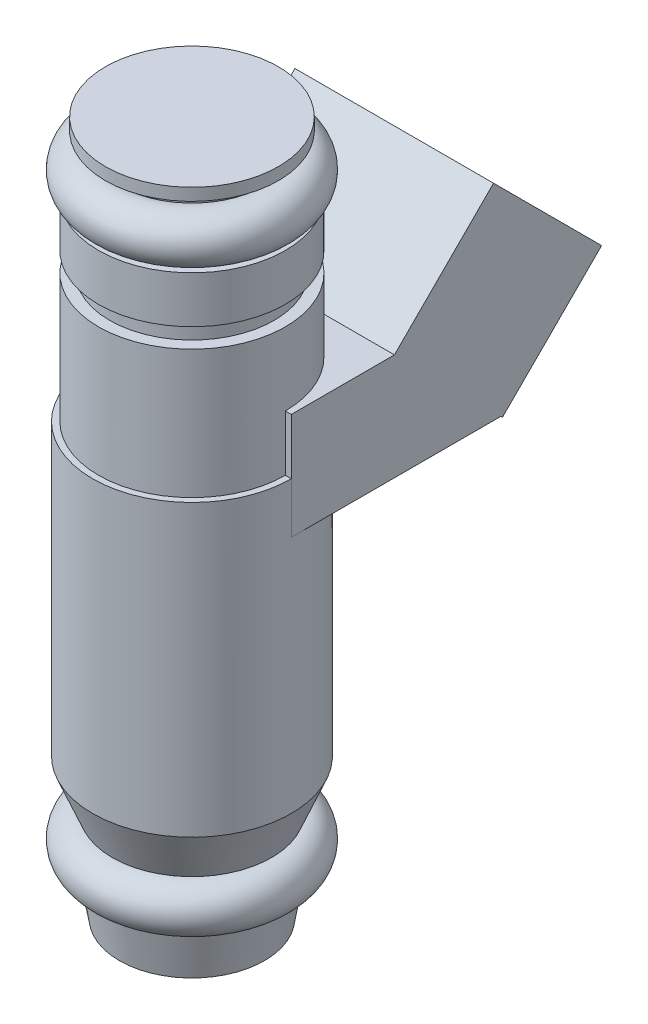
ISO-10303-21;
HEADER;
FILE_DESCRIPTION(('STEP AP214'),'2;1');
FILE_NAME('part.step','',(''),(''),'','','');
FILE_SCHEMA(('AUTOMOTIVE_DESIGN { 1 0 10303 214 1 1 1 1 }'));
ENDSEC;
DATA;
#1=APPLICATION_CONTEXT('core data for automotive mechanical design processes');
#2=APPLICATION_PROTOCOL_DEFINITION('international standard','automotive_design',2000,#1);
#3=PRODUCT_CONTEXT('',#1,'mechanical');
#4=PRODUCT('Part','Part','',(#3));
#5=PRODUCT_RELATED_PRODUCT_CATEGORY('part','',(#4));
#6=PRODUCT_DEFINITION_FORMATION('','',#4);
#7=PRODUCT_DEFINITION_CONTEXT('part definition',#1,'design');
#8=PRODUCT_DEFINITION('design','',#6,#7);
#9=PRODUCT_DEFINITION_SHAPE('','',#8);
#10=(LENGTH_UNIT() NAMED_UNIT(*) SI_UNIT(.MILLI.,.METRE.));
#11=(NAMED_UNIT(*) PLANE_ANGLE_UNIT() SI_UNIT($,.RADIAN.));
#12=(NAMED_UNIT(*) SI_UNIT($,.STERADIAN.) SOLID_ANGLE_UNIT());
#13=UNCERTAINTY_MEASURE_WITH_UNIT(LENGTH_MEASURE(1.E-05),#10,'distance_accuracy_value','');
#14=(GEOMETRIC_REPRESENTATION_CONTEXT(3) GLOBAL_UNCERTAINTY_ASSIGNED_CONTEXT((#13)) GLOBAL_UNIT_ASSIGNED_CONTEXT((#10,
#11,#12)) REPRESENTATION_CONTEXT('',''));
#15=CARTESIAN_POINT('',(0.,0.,0.));
#16=DIRECTION('',(0.,0.,1.));
#17=DIRECTION('',(1.,0.,0.));
#18=AXIS2_PLACEMENT_3D('',#15,#16,#17);
#19=CARTESIAN_POINT('',(0.,42.4843170298998,0.));
#20=DIRECTION('',(0.,1.,0.));
#21=DIRECTION('',(0.,0.,1.));
#22=AXIS2_PLACEMENT_3D('',#19,#20,#21);
#23=CYLINDRICAL_SURFACE('',#22,6.3463459854996);
#24=CARTESIAN_POINT('',(0.,34.6075,0.));
#25=DIRECTION('',(0.,1.,0.));
#26=DIRECTION('',(0.,0.,1.));
#27=AXIS2_PLACEMENT_3D('',#24,#25,#26);
#28=CIRCLE('',#27,6.3463459854996);
#29=CARTESIAN_POINT('',(0.,34.6075,6.3463459854996));
#30=VERTEX_POINT('',#29);
#31=EDGE_CURVE('E234',#30,#30,#28,.T.);
#32=ORIENTED_EDGE('',*,*,#31,.T.);
#33=EDGE_LOOP('',(#32));
#34=FACE_BOUND('',#33,.T.);
#35=CARTESIAN_POINT('',(0.,37.7825,0.));
#36=DIRECTION('',(0.,1.,0.));
#37=DIRECTION('',(0.,0.,1.));
#38=AXIS2_PLACEMENT_3D('',#35,#36,#37);
#39=CIRCLE('',#38,6.3463459854996);
#40=CARTESIAN_POINT('',(0.,37.7825,6.3463459854996));
#41=VERTEX_POINT('',#40);
#42=EDGE_CURVE('E189',#41,#41,#39,.T.);
#43=ORIENTED_EDGE('',*,*,#42,.F.);
#44=EDGE_LOOP('',(#43));
#45=FACE_BOUND('',#44,.T.);
#46=ADVANCED_FACE('F32',(#34,#45),#23,.T.);
#47=CARTESIAN_POINT('',(0.,34.6075,6.3463459854996));
#48=DIRECTION('',(0.,-1.,0.));
#49=DIRECTION('',(0.,0.,-1.));
#50=AXIS2_PLACEMENT_3D('',#47,#48,#49);
#51=PLANE('',#50);
#52=CARTESIAN_POINT('',(0.,34.6075,0.));
#53=DIRECTION('',(0.,1.,0.));
#54=DIRECTION('',(0.,0.,1.));
#55=AXIS2_PLACEMENT_3D('',#52,#53,#54);
#56=CIRCLE('',#55,5.588);
#57=CARTESIAN_POINT('',(0.,34.6075,5.588));
#58=VERTEX_POINT('',#57);
#59=EDGE_CURVE('E231',#58,#58,#56,.T.);
#60=ORIENTED_EDGE('',*,*,#59,.T.);
#61=EDGE_LOOP('',(#60));
#62=FACE_BOUND('',#61,.T.);
#63=ORIENTED_EDGE('',*,*,#31,.F.);
#64=EDGE_LOOP('',(#63));
#65=FACE_BOUND('',#64,.T.);
#66=ADVANCED_FACE('F275',(#62,#65),#51,.T.);
#67=CARTESIAN_POINT('',(0.,42.4843170298998,0.));
#68=DIRECTION('',(0.,1.,0.));
#69=DIRECTION('',(0.,0.,1.));
#70=AXIS2_PLACEMENT_3D('',#67,#68,#69);
#71=CYLINDRICAL_SURFACE('',#70,5.588);
#72=CARTESIAN_POINT('',(0.,33.2867,0.));
#73=DIRECTION('',(0.,1.,0.));
#74=DIRECTION('',(0.,0.,1.));
#75=AXIS2_PLACEMENT_3D('',#72,#73,#74);
#76=CIRCLE('',#75,5.588);
#77=CARTESIAN_POINT('',(0.,33.2867,5.588));
#78=VERTEX_POINT('',#77);
#79=EDGE_CURVE('E228',#78,#78,#76,.T.);
#80=ORIENTED_EDGE('',*,*,#79,.T.);
#81=EDGE_LOOP('',(#80));
#82=FACE_BOUND('',#81,.T.);
#83=ORIENTED_EDGE('',*,*,#59,.F.);
#84=EDGE_LOOP('',(#83));
#85=FACE_BOUND('',#84,.T.);
#86=ADVANCED_FACE('F280',(#82,#85),#71,.T.);
#87=CARTESIAN_POINT('',(0.,33.2867,5.588));
#88=DIRECTION('',(0.,1.,0.));
#89=DIRECTION('',(0.,0.,1.));
#90=AXIS2_PLACEMENT_3D('',#87,#88,#89);
#91=PLANE('',#90);
#92=CARTESIAN_POINT('',(0.,33.2867,0.));
#93=DIRECTION('',(0.,1.,0.));
#94=DIRECTION('',(0.,0.,1.));
#95=AXIS2_PLACEMENT_3D('',#92,#93,#94);
#96=CIRCLE('',#95,6.34634598549959);
#97=CARTESIAN_POINT('',(0.,33.2867,6.34634598549959));
#98=VERTEX_POINT('',#97);
#99=EDGE_CURVE('E225',#98,#98,#96,.T.);
#100=ORIENTED_EDGE('',*,*,#99,.T.);
#101=EDGE_LOOP('',(#100));
#102=FACE_BOUND('',#101,.T.);
#103=ORIENTED_EDGE('',*,*,#79,.F.);
#104=EDGE_LOOP('',(#103));
#105=FACE_BOUND('',#104,.T.);
#106=ADVANCED_FACE('F343',(#102,#105),#91,.T.);
#107=CARTESIAN_POINT('',(0.,42.4843170298998,0.));
#108=DIRECTION('',(0.,1.,0.));
#109=DIRECTION('',(0.,0.,1.));
#110=AXIS2_PLACEMENT_3D('',#107,#108,#109);
#111=CYLINDRICAL_SURFACE('',#110,6.34634598549959);
#112=DIRECTION('',(0.,1.,0.));
#113=VECTOR('',#112,1.);
#114=CARTESIAN_POINT('',(6.34634598549959,42.4843170298998,0.));
#115=LINE('',#114,#113);
#116=CARTESIAN_POINT('',(6.34634598549959,28.3369046984566,0.));
#117=VERTEX_POINT('',#116);
#118=CARTESIAN_POINT('',(6.34634598549959,24.5525120865286,0.));
#119=VERTEX_POINT('',#118);
#120=EDGE_CURVE('E176',#117,#119,#115,.F.);
#121=ORIENTED_EDGE('',*,*,#120,.F.);
#122=CARTESIAN_POINT('',(0.,28.3369046984566,0.));
#123=DIRECTION('',(0.,1.,0.));
#124=DIRECTION('',(0.,0.,1.));
#125=AXIS2_PLACEMENT_3D('',#122,#123,#124);
#126=CIRCLE('',#125,6.34634598549959);
#127=CARTESIAN_POINT('',(-6.34634598549959,28.3369046984566,0.));
#128=VERTEX_POINT('',#127);
#129=EDGE_CURVE('E11',#128,#117,#126,.F.);
#130=ORIENTED_EDGE('',*,*,#129,.F.);
#131=DIRECTION('',(0.,1.,0.));
#132=VECTOR('',#131,1.);
#133=CARTESIAN_POINT('',(-6.34634598549959,42.4843170298998,0.));
#134=LINE('',#133,#132);
#135=CARTESIAN_POINT('',(-6.34634598549959,24.5525120865286,0.));
#136=VERTEX_POINT('',#135);
#137=EDGE_CURVE('E187',#136,#128,#134,.T.);
#138=ORIENTED_EDGE('',*,*,#137,.F.);
#139=CARTESIAN_POINT('',(0.,24.5525120865286,0.));
#140=DIRECTION('',(0.,1.,0.));
#141=DIRECTION('',(0.,0.,1.));
#142=AXIS2_PLACEMENT_3D('',#139,#140,#141);
#143=CIRCLE('',#142,6.34634598549959);
#144=EDGE_CURVE('E222',#136,#119,#143,.T.);
#145=ORIENTED_EDGE('',*,*,#144,.T.);
#146=EDGE_LOOP('',(#121,#130,#138,#145));
#147=FACE_BOUND('',#146,.T.);
#148=ORIENTED_EDGE('',*,*,#99,.F.);
#149=EDGE_LOOP('',(#148));
#150=FACE_BOUND('',#149,.T.);
#151=ADVANCED_FACE('F257',(#147,#150),#111,.T.);
#152=CARTESIAN_POINT('',(0.,24.5525120865286,6.34634598549959));
#153=DIRECTION('',(0.,1.,0.));
#154=DIRECTION('',(0.,0.,1.));
#155=AXIS2_PLACEMENT_3D('',#152,#153,#154);
#156=PLANE('',#155);
#157=DIRECTION('',(1.,0.,0.));
#158=VECTOR('',#157,1.);
#159=CARTESIAN_POINT('',(0.,24.5525120865286,0.));
#160=LINE('',#159,#158);
#161=CARTESIAN_POINT('',(-6.75000000000001,24.5525120865286,0.));
#162=VERTEX_POINT('',#161);
#163=EDGE_CURVE('E56',#162,#136,#160,.T.);
#164=ORIENTED_EDGE('',*,*,#163,.F.);
#165=CARTESIAN_POINT('',(0.,24.5525120865286,0.));
#166=DIRECTION('',(0.,1.,0.));
#167=DIRECTION('',(0.,0.,1.));
#168=AXIS2_PLACEMENT_3D('',#165,#166,#167);
#169=CIRCLE('',#168,6.75000000000001);
#170=CARTESIAN_POINT('',(6.75000000000001,24.5525120865286,0.));
#171=VERTEX_POINT('',#170);
#172=EDGE_CURVE('E219',#162,#171,#169,.T.);
#173=ORIENTED_EDGE('',*,*,#172,.T.);
#174=EDGE_CURVE('E174',#119,#171,#160,.T.);
#175=ORIENTED_EDGE('',*,*,#174,.F.);
#176=ORIENTED_EDGE('',*,*,#144,.F.);
#177=EDGE_LOOP('',(#164,#173,#175,#176));
#178=FACE_BOUND('',#177,.T.);
#179=ADVANCED_FACE('F253',(#178),#156,.T.);
#180=CARTESIAN_POINT('',(0.,42.4843170298998,0.));
#181=DIRECTION('',(0.,1.,0.));
#182=DIRECTION('',(0.,0.,1.));
#183=AXIS2_PLACEMENT_3D('',#180,#181,#182);
#184=CYLINDRICAL_SURFACE('',#183,6.75000000000001);
#185=DIRECTION('',(0.,1.,0.));
#186=VECTOR('',#185,1.);
#187=CARTESIAN_POINT('',(6.75000000000001,28.3369046984566,0.));
#188=LINE('',#187,#186);
#189=CARTESIAN_POINT('',(6.75000000000001,21.1028738939092,0.));
#190=VERTEX_POINT('',#189);
#191=EDGE_CURVE('E159',#190,#171,#188,.T.);
#192=ORIENTED_EDGE('',*,*,#191,.T.);
#193=ORIENTED_EDGE('',*,*,#172,.F.);
#194=DIRECTION('',(0.,1.,0.));
#195=VECTOR('',#194,1.);
#196=CARTESIAN_POINT('',(-6.75000000000001,42.4843170298998,0.));
#197=LINE('',#196,#195);
#198=CARTESIAN_POINT('',(-6.75000000000001,21.1028738939092,0.));
#199=VERTEX_POINT('',#198);
#200=EDGE_CURVE('E237',#162,#199,#197,.F.);
#201=ORIENTED_EDGE('',*,*,#200,.T.);
#202=CARTESIAN_POINT('',(0.,21.1028738939092,0.));
#203=DIRECTION('',(0.,-1.,0.));
#204=DIRECTION('',(0.,0.,-1.));
#205=AXIS2_PLACEMENT_3D('',#202,#203,#204);
#206=CIRCLE('',#205,6.75000000000001);
#207=EDGE_CURVE('E40',#190,#199,#206,.F.);
#208=ORIENTED_EDGE('',*,*,#207,.F.);
#209=EDGE_LOOP('',(#192,#193,#201,#208));
#210=FACE_BOUND('',#209,.T.);
#211=CARTESIAN_POINT('',(0.,4.85143780799259,0.));
#212=DIRECTION('',(0.,1.,0.));
#213=DIRECTION('',(0.,0.,1.));
#214=AXIS2_PLACEMENT_3D('',#211,#212,#213);
#215=CIRCLE('',#214,6.75000000000001);
#216=CARTESIAN_POINT('',(0.,4.85143780799259,6.75000000000001));
#217=VERTEX_POINT('',#216);
#218=EDGE_CURVE('E216',#217,#217,#215,.T.);
#219=ORIENTED_EDGE('',*,*,#218,.T.);
#220=EDGE_LOOP('',(#219));
#221=FACE_BOUND('',#220,.T.);
#222=ADVANCED_FACE('F247',(#210,#221),#184,.T.);
#223=CARTESIAN_POINT('',(0.,4.85143780799259,0.));
#224=DIRECTION('',(0.,1.,0.));
#225=DIRECTION('',(0.,0.,1.));
#226=AXIS2_PLACEMENT_3D('',#223,#224,#225);
#227=CONICAL_SURFACE('',#226,6.75000000000001,0.388909811684261);
#228=CARTESIAN_POINT('',(0.,1.5875,0.));
#229=DIRECTION('',(0.,1.,0.));
#230=DIRECTION('',(0.,0.,1.));
#231=AXIS2_PLACEMENT_3D('',#228,#229,#230);
#232=CIRCLE('',#231,5.41250000000001);
#233=CARTESIAN_POINT('',(0.,1.5875,5.41250000000001));
#234=VERTEX_POINT('',#233);
#235=EDGE_CURVE('E213',#234,#234,#232,.T.);
#236=ORIENTED_EDGE('',*,*,#235,.T.);
#237=EDGE_LOOP('',(#236));
#238=FACE_BOUND('',#237,.T.);
#239=ORIENTED_EDGE('',*,*,#218,.F.);
#240=EDGE_LOOP('',(#239));
#241=FACE_BOUND('',#240,.T.);
#242=ADVANCED_FACE('F332',(#238,#241),#227,.T.);
#243=CARTESIAN_POINT('',(0.,0.,0.));
#244=DIRECTION('',(0.,1.,0.));
#245=DIRECTION('',(0.,0.,1.));
#246=AXIS2_PLACEMENT_3D('',#243,#244,#245);
#247=TOROIDAL_SURFACE('',#246,5.41250000000001,1.5875);
#248=CARTESIAN_POINT('',(0.,-1.58508674841474,0.));
#249=DIRECTION('',(0.,1.,0.));
#250=DIRECTION('',(0.,0.,1.));
#251=AXIS2_PLACEMENT_3D('',#248,#249,#250);
#252=CIRCLE('',#251,5.49999999999999);
#253=CARTESIAN_POINT('',(0.,-1.58508674841474,5.49999999999999));
#254=VERTEX_POINT('',#253);
#255=EDGE_CURVE('E210',#254,#254,#252,.T.);
#256=ORIENTED_EDGE('',*,*,#255,.T.);
#257=EDGE_LOOP('',(#256));
#258=FACE_BOUND('',#257,.T.);
#259=ORIENTED_EDGE('',*,*,#235,.F.);
#260=EDGE_LOOP('',(#259));
#261=FACE_BOUND('',#260,.T.);
#262=ADVANCED_FACE('F328',(#258,#261),#247,.T.);
#263=CARTESIAN_POINT('',(0.,-1.58508674841474,0.));
#264=DIRECTION('',(0.,1.,0.));
#265=DIRECTION('',(0.,0.,1.));
#266=AXIS2_PLACEMENT_3D('',#263,#264,#265);
#267=CONICAL_SURFACE('',#266,5.49999999999999,0.178973591686608);
#268=CARTESIAN_POINT('',(0.,-4.7156829701002,0.));
#269=DIRECTION('',(0.,1.,0.));
#270=DIRECTION('',(0.,0.,1.));
#271=AXIS2_PLACEMENT_3D('',#268,#269,#270);
#272=CIRCLE('',#271,4.93364593188048);
#273=CARTESIAN_POINT('',(0.,-4.7156829701002,4.93364593188048));
#274=VERTEX_POINT('',#273);
#275=EDGE_CURVE('E207',#274,#274,#272,.T.);
#276=ORIENTED_EDGE('',*,*,#275,.T.);
#277=EDGE_LOOP('',(#276));
#278=FACE_BOUND('',#277,.T.);
#279=ORIENTED_EDGE('',*,*,#255,.F.);
#280=EDGE_LOOP('',(#279));
#281=FACE_BOUND('',#280,.T.);
#282=ADVANCED_FACE('F322',(#278,#281),#267,.T.);
#283=CARTESIAN_POINT('',(0.,-4.7156829701002,4.93364593188048));
#284=DIRECTION('',(0.,-1.,0.));
#285=DIRECTION('',(0.,0.,-1.));
#286=AXIS2_PLACEMENT_3D('',#283,#284,#285);
#287=PLANE('',#286);
#288=ORIENTED_EDGE('',*,*,#275,.F.);
#289=EDGE_LOOP('',(#288));
#290=FACE_BOUND('',#289,.T.);
#291=ADVANCED_FACE('F317',(#290),#287,.T.);
#292=CARTESIAN_POINT('',(0.,42.4843170298998,0.));
#293=DIRECTION('',(0.,1.,0.));
#294=DIRECTION('',(0.,0.,1.));
#295=AXIS2_PLACEMENT_3D('',#292,#293,#294);
#296=PLANE('',#295);
#297=CARTESIAN_POINT('',(0.,42.4843170298998,0.));
#298=DIRECTION('',(0.,1.,0.));
#299=DIRECTION('',(0.,0.,1.));
#300=AXIS2_PLACEMENT_3D('',#297,#298,#299);
#301=CIRCLE('',#300,5.88002652383953);
#302=CARTESIAN_POINT('',(0.,42.4843170298998,5.88002652383953));
#303=VERTEX_POINT('',#302);
#304=EDGE_CURVE('E204',#303,#303,#301,.T.);
#305=ORIENTED_EDGE('',*,*,#304,.T.);
#306=EDGE_LOOP('',(#305));
#307=FACE_BOUND('',#306,.T.);
#308=ADVANCED_FACE('F312',(#307),#296,.T.);
#309=CARTESIAN_POINT('',(0.,42.4843170298998,0.));
#310=DIRECTION('',(0.,1.,0.));
#311=DIRECTION('',(0.,0.,1.));
#312=AXIS2_PLACEMENT_3D('',#309,#310,#311);
#313=CYLINDRICAL_SURFACE('',#312,5.88002652383953);
#314=CARTESIAN_POINT('',(0.,41.6542235018854,0.));
#315=DIRECTION('',(0.,1.,0.));
#316=DIRECTION('',(0.,0.,1.));
#317=AXIS2_PLACEMENT_3D('',#314,#315,#316);
#318=CIRCLE('',#317,5.88002652383953);
#319=CARTESIAN_POINT('',(0.,41.6542235018854,5.88002652383953));
#320=VERTEX_POINT('',#319);
#321=EDGE_CURVE('E201',#320,#320,#318,.T.);
#322=ORIENTED_EDGE('',*,*,#321,.T.);
#323=EDGE_LOOP('',(#322));
#324=FACE_BOUND('',#323,.T.);
#325=ORIENTED_EDGE('',*,*,#304,.F.);
#326=EDGE_LOOP('',(#325));
#327=FACE_BOUND('',#326,.T.);
#328=ADVANCED_FACE('F306',(#324,#327),#313,.T.);
#329=CARTESIAN_POINT('',(0.,41.6542235018854,5.88002652383953));
#330=DIRECTION('',(0.,-1.,0.));
#331=DIRECTION('',(0.,0.,-1.));
#332=AXIS2_PLACEMENT_3D('',#329,#330,#331);
#333=PLANE('',#332);
#334=CARTESIAN_POINT('',(0.,41.6542235018854,0.));
#335=DIRECTION('',(0.,1.,0.));
#336=DIRECTION('',(0.,0.,1.));
#337=AXIS2_PLACEMENT_3D('',#334,#335,#336);
#338=CIRCLE('',#337,4.93364593188048);
#339=CARTESIAN_POINT('',(0.,41.6542235018854,4.93364593188048));
#340=VERTEX_POINT('',#339);
#341=EDGE_CURVE('E198',#340,#340,#338,.T.);
#342=ORIENTED_EDGE('',*,*,#341,.T.);
#343=EDGE_LOOP('',(#342));
#344=FACE_BOUND('',#343,.T.);
#345=ORIENTED_EDGE('',*,*,#321,.F.);
#346=EDGE_LOOP('',(#345));
#347=FACE_BOUND('',#346,.T.);
#348=ADVANCED_FACE('F300',(#344,#347),#333,.T.);
#349=CARTESIAN_POINT('',(0.,42.4843170298998,0.));
#350=DIRECTION('',(0.,1.,0.));
#351=DIRECTION('',(0.,0.,1.));
#352=AXIS2_PLACEMENT_3D('',#349,#350,#351);
#353=CYLINDRICAL_SURFACE('',#352,4.93364593188048);
#354=CARTESIAN_POINT('',(0.,40.883557079018,0.));
#355=DIRECTION('',(0.,1.,0.));
#356=DIRECTION('',(0.,0.,1.));
#357=AXIS2_PLACEMENT_3D('',#354,#355,#356);
#358=CIRCLE('',#357,4.93364593188048);
#359=CARTESIAN_POINT('',(0.,40.883557079018,4.93364593188048));
#360=VERTEX_POINT('',#359);
#361=EDGE_CURVE('E195',#360,#360,#358,.T.);
#362=ORIENTED_EDGE('',*,*,#361,.T.);
#363=EDGE_LOOP('',(#362));
#364=FACE_BOUND('',#363,.T.);
#365=ORIENTED_EDGE('',*,*,#341,.F.);
#366=EDGE_LOOP('',(#365));
#367=FACE_BOUND('',#366,.T.);
#368=ADVANCED_FACE('F294',(#364,#367),#353,.T.);
#369=CARTESIAN_POINT('',(0.,39.37,0.));
#370=DIRECTION('',(0.,1.,0.));
#371=DIRECTION('',(0.,0.,1.));
#372=AXIS2_PLACEMENT_3D('',#369,#370,#371);
#373=TOROIDAL_SURFACE('',#372,5.4125,1.5875);
#374=CARTESIAN_POINT('',(0.,37.7825,0.));
#375=DIRECTION('',(0.,1.,0.));
#376=DIRECTION('',(0.,0.,1.));
#377=AXIS2_PLACEMENT_3D('',#374,#375,#376);
#378=CIRCLE('',#377,5.4125);
#379=CARTESIAN_POINT('',(0.,37.7825,5.4125));
#380=VERTEX_POINT('',#379);
#381=EDGE_CURVE('E192',#380,#380,#378,.T.);
#382=ORIENTED_EDGE('',*,*,#381,.T.);
#383=EDGE_LOOP('',(#382));
#384=FACE_BOUND('',#383,.T.);
#385=ORIENTED_EDGE('',*,*,#361,.F.);
#386=EDGE_LOOP('',(#385));
#387=FACE_BOUND('',#386,.T.);
#388=ADVANCED_FACE('F288',(#384,#387),#373,.T.);
#389=CARTESIAN_POINT('',(0.,37.7825,5.4125));
#390=DIRECTION('',(0.,1.,0.));
#391=DIRECTION('',(0.,0.,1.));
#392=AXIS2_PLACEMENT_3D('',#389,#390,#391);
#393=PLANE('',#392);
#394=ORIENTED_EDGE('',*,*,#42,.T.);
#395=EDGE_LOOP('',(#394));
#396=FACE_BOUND('',#395,.T.);
#397=ORIENTED_EDGE('',*,*,#381,.F.);
#398=EDGE_LOOP('',(#397));
#399=FACE_BOUND('',#398,.T.);
#400=ADVANCED_FACE('F271',(#396,#399),#393,.T.);
#401=CARTESIAN_POINT('',(-6.75000000000001,21.1028738939092,0.));
#402=DIRECTION('',(0.,0.,1.));
#403=DIRECTION('',(1.,0.,0.));
#404=AXIS2_PLACEMENT_3D('',#401,#402,#403);
#405=PLANE('',#404);
#406=ORIENTED_EDGE('',*,*,#163,.T.);
#407=ORIENTED_EDGE('',*,*,#137,.T.);
#408=DIRECTION('',(-1.,0.,0.));
#409=VECTOR('',#408,1.);
#410=CARTESIAN_POINT('',(-6.75000000000001,28.3369046984566,0.));
#411=LINE('',#410,#409);
#412=CARTESIAN_POINT('',(-6.75000000000001,28.3369046984566,0.));
#413=VERTEX_POINT('',#412);
#414=EDGE_CURVE('E158',#128,#413,#411,.T.);
#415=ORIENTED_EDGE('',*,*,#414,.T.);
#416=DIRECTION('',(0.,-1.,0.));
#417=VECTOR('',#416,1.);
#418=CARTESIAN_POINT('',(-6.75000000000001,28.3369046984566,0.));
#419=LINE('',#418,#417);
#420=EDGE_CURVE('E163',#413,#162,#419,.T.);
#421=ORIENTED_EDGE('',*,*,#420,.T.);
#422=EDGE_LOOP('',(#406,#407,#415,#421));
#423=FACE_BOUND('',#422,.T.);
#424=ADVANCED_FACE('F250',(#423),#405,.T.);
#425=CARTESIAN_POINT('',(6.75000000000001,28.3369046984566,0.));
#426=VERTEX_POINT('',#425);
#427=EDGE_CURVE('E154',#426,#117,#411,.T.);
#428=ORIENTED_EDGE('',*,*,#427,.T.);
#429=ORIENTED_EDGE('',*,*,#120,.T.);
#430=ORIENTED_EDGE('',*,*,#174,.T.);
#431=EDGE_CURVE('E162',#171,#426,#188,.T.);
#432=ORIENTED_EDGE('',*,*,#431,.T.);
#433=EDGE_LOOP('',(#428,#429,#430,#432));
#434=FACE_BOUND('',#433,.T.);
#435=ADVANCED_FACE('F263',(#434),#405,.T.);
#436=CARTESIAN_POINT('',(-6.75000000000001,21.1028738939092,-29.1142230472317));
#437=DIRECTION('',(0.,-1.,0.));
#438=DIRECTION('',(0.,0.,-1.));
#439=AXIS2_PLACEMENT_3D('',#436,#437,#438);
#440=PLANE('',#439);
#441=DIRECTION('',(0.,0.,1.));
#442=VECTOR('',#441,1.);
#443=CARTESIAN_POINT('',(6.75000000000001,21.1028738939092,-29.1142230472317));
#444=LINE('',#443,#442);
#445=CARTESIAN_POINT('',(6.75000000000001,21.1028738939092,-14.2431379600424));
#446=VERTEX_POINT('',#445);
#447=EDGE_CURVE('E171',#446,#190,#444,.T.);
#448=ORIENTED_EDGE('',*,*,#447,.T.);
#449=ORIENTED_EDGE('',*,*,#207,.T.);
#450=DIRECTION('',(0.,0.,1.));
#451=VECTOR('',#450,1.);
#452=CARTESIAN_POINT('',(-6.75000000000001,21.1028738939092,-29.1142230472317));
#453=LINE('',#452,#451);
#454=CARTESIAN_POINT('',(-6.75000000000001,21.1028738939092,-14.2431379600424));
#455=VERTEX_POINT('',#454);
#456=EDGE_CURVE('E48',#455,#199,#453,.T.);
#457=ORIENTED_EDGE('',*,*,#456,.F.);
#458=DIRECTION('',(1.,0.,0.));
#459=VECTOR('',#458,1.);
#460=CARTESIAN_POINT('',(-6.75,21.1028738939092,-14.2431379600424));
#461=LINE('',#460,#459);
#462=EDGE_CURVE('E157',#455,#446,#461,.T.);
#463=ORIENTED_EDGE('',*,*,#462,.T.);
#464=EDGE_LOOP('',(#448,#449,#457,#463));
#465=FACE_BOUND('',#464,.T.);
#466=ADVANCED_FACE('F242',(#465),#440,.T.);
#467=CARTESIAN_POINT('',(6.75000000000001,28.3369046984566,-29.1142230472317));
#468=DIRECTION('',(1.,0.,0.));
#469=DIRECTION('',(0.,0.,-1.));
#470=AXIS2_PLACEMENT_3D('',#467,#468,#469);
#471=PLANE('',#470);
#472=ORIENTED_EDGE('',*,*,#447,.F.);
#473=DIRECTION('',(0.,0.707106781186539,0.707106781186556));
#474=VECTOR('',#473,1.);
#475=CARTESIAN_POINT('',(6.75000000000001,28.3369046984566,-7.00910715549474));
#476=LINE('',#475,#474);
#477=CARTESIAN_POINT('',(6.75000000000001,20.9950755711172,-14.3509362828344));
#478=VERTEX_POINT('',#477);
#479=EDGE_CURVE('E150',#478,#446,#476,.T.);
#480=ORIENTED_EDGE('',*,*,#479,.F.);
#481=DIRECTION('',(0.,-0.707106781186556,0.707106781186539));
#482=VECTOR('',#481,1.);
#483=CARTESIAN_POINT('',(6.75000000000001,27.7302676619191,-21.0861283736362));
#484=LINE('',#483,#482);
#485=CARTESIAN_POINT('',(6.75000000000001,27.7302676619191,-21.0861283736362));
#486=VERTEX_POINT('',#485);
#487=EDGE_CURVE('E137',#486,#478,#484,.T.);
#488=ORIENTED_EDGE('',*,*,#487,.F.);
#489=DIRECTION('',(0.,0.707106781186539,0.707106781186556));
#490=VECTOR('',#489,1.);
#491=CARTESIAN_POINT('',(6.75000000000001,35.0720967892586,-13.7442992462965));
#492=LINE('',#491,#490);
#493=CARTESIAN_POINT('',(6.75000000000001,35.0720967892586,-13.7442992462965));
#494=VERTEX_POINT('',#493);
#495=EDGE_CURVE('E129',#486,#494,#492,.T.);
#496=ORIENTED_EDGE('',*,*,#495,.T.);
#497=DIRECTION('',(0.,-0.707106781186556,0.707106781186539));
#498=VECTOR('',#497,1.);
#499=CARTESIAN_POINT('',(6.75000000000001,35.0720967892586,-13.7442992462965));
#500=LINE('',#499,#498);
#501=CARTESIAN_POINT('',(6.75000000000001,28.3369046984566,-7.00910715549474));
#502=VERTEX_POINT('',#501);
#503=EDGE_CURVE('E111',#494,#502,#500,.T.);
#504=ORIENTED_EDGE('',*,*,#503,.T.);
#505=DIRECTION('',(0.,0.,1.));
#506=VECTOR('',#505,1.);
#507=CARTESIAN_POINT('',(6.75000000000001,28.3369046984566,-29.1142230472317));
#508=LINE('',#507,#506);
#509=EDGE_CURVE('E183',#502,#426,#508,.T.);
#510=ORIENTED_EDGE('',*,*,#509,.T.);
#511=ORIENTED_EDGE('',*,*,#431,.F.);
#512=ORIENTED_EDGE('',*,*,#191,.F.);
#513=EDGE_LOOP('',(#472,#480,#488,#496,#504,#510,#511,#512));
#514=FACE_BOUND('',#513,.T.);
#515=ADVANCED_FACE('F135',(#514),#471,.T.);
#516=CARTESIAN_POINT('',(-6.75000000000001,28.3369046984566,-29.1142230472317));
#517=DIRECTION('',(0.,1.,0.));
#518=DIRECTION('',(0.,0.,1.));
#519=AXIS2_PLACEMENT_3D('',#516,#517,#518);
#520=PLANE('',#519);
#521=ORIENTED_EDGE('',*,*,#414,.F.);
#522=ORIENTED_EDGE('',*,*,#129,.T.);
#523=ORIENTED_EDGE('',*,*,#427,.F.);
#524=ORIENTED_EDGE('',*,*,#509,.F.);
#525=DIRECTION('',(-1.,0.,0.));
#526=VECTOR('',#525,1.);
#527=CARTESIAN_POINT('',(-6.75,28.3369046984566,-7.00910715549474));
#528=LINE('',#527,#526);
#529=CARTESIAN_POINT('',(-6.75000000000001,28.3369046984566,-7.00910715549474));
#530=VERTEX_POINT('',#529);
#531=EDGE_CURVE('E116',#502,#530,#528,.T.);
#532=ORIENTED_EDGE('',*,*,#531,.T.);
#533=DIRECTION('',(0.,0.,1.));
#534=VECTOR('',#533,1.);
#535=CARTESIAN_POINT('',(-6.75000000000001,28.3369046984566,-29.1142230472317));
#536=LINE('',#535,#534);
#537=EDGE_CURVE('E175',#530,#413,#536,.T.);
#538=ORIENTED_EDGE('',*,*,#537,.T.);
#539=EDGE_LOOP('',(#521,#522,#523,#524,#532,#538));
#540=FACE_BOUND('',#539,.T.);
#541=ADVANCED_FACE('F260',(#540),#520,.T.);
#542=CARTESIAN_POINT('',(-6.75000000000001,28.3369046984566,-29.1142230472317));
#543=DIRECTION('',(-1.,0.,0.));
#544=DIRECTION('',(0.,-1.,0.));
#545=AXIS2_PLACEMENT_3D('',#542,#543,#544);
#546=PLANE('',#545);
#547=ORIENTED_EDGE('',*,*,#537,.F.);
#548=DIRECTION('',(0.,-0.707106781186556,0.707106781186539));
#549=VECTOR('',#548,1.);
#550=CARTESIAN_POINT('',(-6.75000000000001,35.0720967892586,-13.7442992462965));
#551=LINE('',#550,#549);
#552=CARTESIAN_POINT('',(-6.75000000000001,35.0720967892586,-13.7442992462965));
#553=VERTEX_POINT('',#552);
#554=EDGE_CURVE('E121',#553,#530,#551,.T.);
#555=ORIENTED_EDGE('',*,*,#554,.F.);
#556=DIRECTION('',(0.,-0.707106781186539,-0.707106781186556));
#557=VECTOR('',#556,1.);
#558=CARTESIAN_POINT('',(-6.75000000000001,35.0720967892586,-13.7442992462965));
#559=LINE('',#558,#557);
#560=CARTESIAN_POINT('',(-6.75000000000001,27.7302676619191,-21.0861283736362));
#561=VERTEX_POINT('',#560);
#562=EDGE_CURVE('E132',#553,#561,#559,.T.);
#563=ORIENTED_EDGE('',*,*,#562,.T.);
#564=DIRECTION('',(0.,-0.707106781186556,0.707106781186539));
#565=VECTOR('',#564,1.);
#566=CARTESIAN_POINT('',(-6.75000000000001,27.7302676619191,-21.0861283736362));
#567=LINE('',#566,#565);
#568=CARTESIAN_POINT('',(-6.75000000000001,20.9950755711172,-14.3509362828344));
#569=VERTEX_POINT('',#568);
#570=EDGE_CURVE('E509',#561,#569,#567,.T.);
#571=ORIENTED_EDGE('',*,*,#570,.T.);
#572=DIRECTION('',(0.,-0.707106781186539,-0.707106781186556));
#573=VECTOR('',#572,1.);
#574=CARTESIAN_POINT('',(-6.75000000000001,28.3369046984566,-7.00910715549474));
#575=LINE('',#574,#573);
#576=EDGE_CURVE('E141',#455,#569,#575,.T.);
#577=ORIENTED_EDGE('',*,*,#576,.F.);
#578=ORIENTED_EDGE('',*,*,#456,.T.);
#579=ORIENTED_EDGE('',*,*,#200,.F.);
#580=ORIENTED_EDGE('',*,*,#420,.F.);
#581=EDGE_LOOP('',(#547,#555,#563,#571,#577,#578,#579,#580));
#582=FACE_BOUND('',#581,.T.);
#583=ADVANCED_FACE('F249',(#582),#546,.T.);
#584=CARTESIAN_POINT('',(6.75000000000001,27.7302676619191,-21.0861283736362));
#585=DIRECTION('',(0.,-0.707106781186539,-0.707106781186556));
#586=DIRECTION('',(0.,0.707106781186556,-0.707106781186539));
#587=AXIS2_PLACEMENT_3D('',#584,#585,#586);
#588=PLANE('',#587);
#589=DIRECTION('',(1.,0.,0.));
#590=VECTOR('',#589,1.);
#591=CARTESIAN_POINT('',(6.75000000000001,20.9950755711172,-14.3509362828344));
#592=LINE('',#591,#590);
#593=EDGE_CURVE('E138',#569,#478,#592,.T.);
#594=ORIENTED_EDGE('',*,*,#593,.F.);
#595=ORIENTED_EDGE('',*,*,#570,.F.);
#596=DIRECTION('',(1.,0.,0.));
#597=VECTOR('',#596,1.);
#598=CARTESIAN_POINT('',(6.75000000000001,27.7302676619191,-21.0861283736362));
#599=LINE('',#598,#597);
#600=EDGE_CURVE('E122',#561,#486,#599,.T.);
#601=ORIENTED_EDGE('',*,*,#600,.T.);
#602=ORIENTED_EDGE('',*,*,#487,.T.);
#603=EDGE_LOOP('',(#594,#595,#601,#602));
#604=FACE_BOUND('',#603,.T.);
#605=ADVANCED_FACE('F468',(#604),#588,.T.);
#606=CARTESIAN_POINT('',(6.75000000000001,35.0720967892586,-13.7442992462965));
#607=DIRECTION('',(0.,0.707106781186539,0.707106781186556));
#608=DIRECTION('',(0.,-0.707106781186556,0.707106781186539));
#609=AXIS2_PLACEMENT_3D('',#606,#607,#608);
#610=PLANE('',#609);
#611=ORIENTED_EDGE('',*,*,#531,.F.);
#612=ORIENTED_EDGE('',*,*,#503,.F.);
#613=DIRECTION('',(-1.,0.,0.));
#614=VECTOR('',#613,1.);
#615=CARTESIAN_POINT('',(6.75000000000001,35.0720967892586,-13.7442992462965));
#616=LINE('',#615,#614);
#617=EDGE_CURVE('E114',#494,#553,#616,.T.);
#618=ORIENTED_EDGE('',*,*,#617,.T.);
#619=ORIENTED_EDGE('',*,*,#554,.T.);
#620=EDGE_LOOP('',(#611,#612,#618,#619));
#621=FACE_BOUND('',#620,.T.);
#622=ADVANCED_FACE('F113',(#621),#610,.T.);
#623=CARTESIAN_POINT('',(6.75000000000001,27.7302676619191,-21.0861283736362));
#624=DIRECTION('',(0.,0.707106781186556,-0.707106781186539));
#625=DIRECTION('',(0.,0.707106781186539,0.707106781186556));
#626=AXIS2_PLACEMENT_3D('',#623,#624,#625);
#627=PLANE('',#626);
#628=ORIENTED_EDGE('',*,*,#495,.F.);
#629=ORIENTED_EDGE('',*,*,#600,.F.);
#630=ORIENTED_EDGE('',*,*,#562,.F.);
#631=ORIENTED_EDGE('',*,*,#617,.F.);
#632=EDGE_LOOP('',(#628,#629,#630,#631));
#633=FACE_BOUND('',#632,.T.);
#634=ADVANCED_FACE('F127',(#633),#627,.T.);
#635=CARTESIAN_POINT('',(6.75000000000001,20.9950755711172,-14.3509362828344));
#636=DIRECTION('',(0.,0.707106781186556,-0.707106781186539));
#637=DIRECTION('',(0.,0.707106781186539,0.707106781186556));
#638=AXIS2_PLACEMENT_3D('',#635,#636,#637);
#639=PLANE('',#638);
#640=ORIENTED_EDGE('',*,*,#462,.F.);
#641=ORIENTED_EDGE('',*,*,#576,.T.);
#642=ORIENTED_EDGE('',*,*,#593,.T.);
#643=ORIENTED_EDGE('',*,*,#479,.T.);
#644=EDGE_LOOP('',(#640,#641,#642,#643));
#645=FACE_BOUND('',#644,.T.);
#646=ADVANCED_FACE('F491',(#645),#639,.F.);
#647=CLOSED_SHELL('',(#46,#66,#86,#106,#151,#179,#222,#242,#262,#282,#291,#308,#328,#348,#368,
#388,#400,#424,#435,#466,#515,#541,#583,#605,#622,#634,#646));
#648=MANIFOLD_SOLID_BREP('B2',#647);
#649=ADVANCED_BREP_SHAPE_REPRESENTATION('',(#18,#648),#14);
#650=SHAPE_DEFINITION_REPRESENTATION(#9,#649);
ENDSEC;
END-ISO-10303-21;
